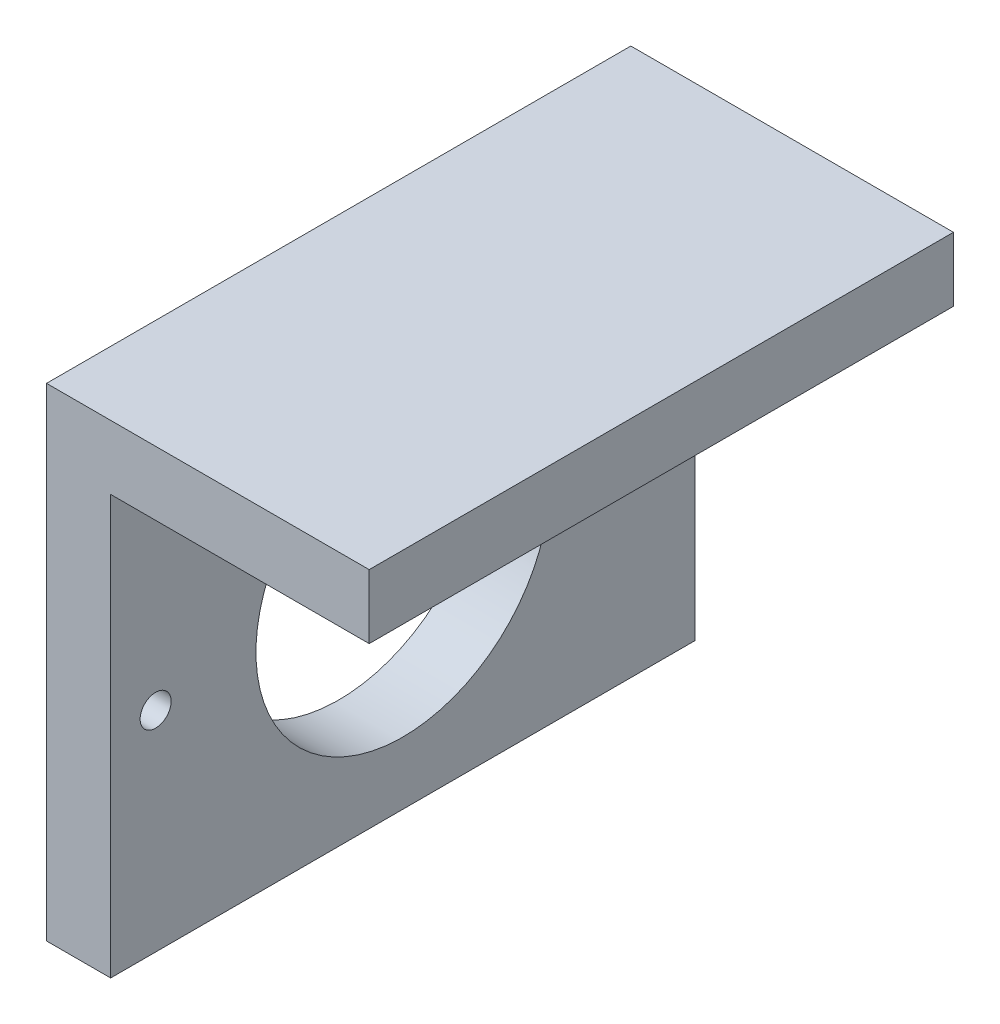
ISO-10303-21;
HEADER;
FILE_DESCRIPTION(('STEP AP214'),'2;1');
FILE_NAME('part.step','',(''),(''),'','','');
FILE_SCHEMA(('AUTOMOTIVE_DESIGN { 1 0 10303 214 1 1 1 1 }'));
ENDSEC;
DATA;
#1=APPLICATION_CONTEXT('core data for automotive mechanical design processes');
#2=APPLICATION_PROTOCOL_DEFINITION('international standard','automotive_design',2000,#1);
#3=PRODUCT_CONTEXT('',#1,'mechanical');
#4=PRODUCT('Part','Part','',(#3));
#5=PRODUCT_RELATED_PRODUCT_CATEGORY('part','',(#4));
#6=PRODUCT_DEFINITION_FORMATION('','',#4);
#7=PRODUCT_DEFINITION_CONTEXT('part definition',#1,'design');
#8=PRODUCT_DEFINITION('design','',#6,#7);
#9=PRODUCT_DEFINITION_SHAPE('','',#8);
#10=(LENGTH_UNIT() NAMED_UNIT(*) SI_UNIT(.MILLI.,.METRE.));
#11=(NAMED_UNIT(*) PLANE_ANGLE_UNIT() SI_UNIT($,.RADIAN.));
#12=(NAMED_UNIT(*) SI_UNIT($,.STERADIAN.) SOLID_ANGLE_UNIT());
#13=UNCERTAINTY_MEASURE_WITH_UNIT(LENGTH_MEASURE(1.E-05),#10,'distance_accuracy_value','');
#14=(GEOMETRIC_REPRESENTATION_CONTEXT(3) GLOBAL_UNCERTAINTY_ASSIGNED_CONTEXT((#13)) GLOBAL_UNIT_ASSIGNED_CONTEXT((#10,
#11,#12)) REPRESENTATION_CONTEXT('',''));
#15=CARTESIAN_POINT('',(0.,0.,0.));
#16=DIRECTION('',(0.,0.,1.));
#17=DIRECTION('',(1.,0.,0.));
#18=AXIS2_PLACEMENT_3D('',#15,#16,#17);
#19=CARTESIAN_POINT('',(6.2,0.,0.));
#20=DIRECTION('',(0.,1.,0.));
#21=DIRECTION('',(0.,0.,1.));
#22=AXIS2_PLACEMENT_3D('',#19,#20,#21);
#23=PLANE('',#22);
#24=DIRECTION('',(0.,0.,-1.));
#25=VECTOR('',#24,1.);
#26=CARTESIAN_POINT('',(0.,0.,0.));
#27=LINE('',#26,#25);
#28=CARTESIAN_POINT('',(0.,0.,0.));
#29=VERTEX_POINT('',#28);
#30=CARTESIAN_POINT('',(0.,0.,-56.5));
#31=VERTEX_POINT('',#30);
#32=EDGE_CURVE('E85',#29,#31,#27,.T.);
#33=ORIENTED_EDGE('',*,*,#32,.T.);
#34=DIRECTION('',(-1.,0.,0.));
#35=VECTOR('',#34,1.);
#36=CARTESIAN_POINT('',(6.2,0.,-56.5));
#37=LINE('',#36,#35);
#38=CARTESIAN_POINT('',(6.2,0.,-56.5));
#39=VERTEX_POINT('',#38);
#40=EDGE_CURVE('E11',#39,#31,#37,.T.);
#41=ORIENTED_EDGE('',*,*,#40,.F.);
#42=DIRECTION('',(0.,0.,-1.));
#43=VECTOR('',#42,1.);
#44=CARTESIAN_POINT('',(6.2,0.,0.));
#45=LINE('',#44,#43);
#46=CARTESIAN_POINT('',(6.2,0.,0.));
#47=VERTEX_POINT('',#46);
#48=EDGE_CURVE('E87',#47,#39,#45,.T.);
#49=ORIENTED_EDGE('',*,*,#48,.F.);
#50=DIRECTION('',(-1.,0.,0.));
#51=VECTOR('',#50,1.);
#52=CARTESIAN_POINT('',(6.2,0.,0.));
#53=LINE('',#52,#51);
#54=EDGE_CURVE('E65',#47,#29,#53,.T.);
#55=ORIENTED_EDGE('',*,*,#54,.T.);
#56=EDGE_LOOP('',(#33,#41,#49,#55));
#57=FACE_BOUND('',#56,.T.);
#58=ADVANCED_FACE('F41',(#57),#23,.F.);
#59=CARTESIAN_POINT('',(6.2,0.,-56.5));
#60=DIRECTION('',(0.,0.,1.));
#61=DIRECTION('',(1.,0.,0.));
#62=AXIS2_PLACEMENT_3D('',#59,#60,#61);
#63=PLANE('',#62);
#64=DIRECTION('',(0.,1.,0.));
#65=VECTOR('',#64,1.);
#66=CARTESIAN_POINT('',(0.,0.,-56.5));
#67=LINE('',#66,#65);
#68=CARTESIAN_POINT('',(0.,46.7,-56.5));
#69=VERTEX_POINT('',#68);
#70=EDGE_CURVE('E98',#31,#69,#67,.T.);
#71=ORIENTED_EDGE('',*,*,#70,.T.);
#72=DIRECTION('',(-1.,0.,0.));
#73=VECTOR('',#72,1.);
#74=CARTESIAN_POINT('',(6.2,46.7,-56.5));
#75=LINE('',#74,#73);
#76=CARTESIAN_POINT('',(31.2,46.7,-56.5));
#77=VERTEX_POINT('',#76);
#78=EDGE_CURVE('E50',#77,#69,#75,.T.);
#79=ORIENTED_EDGE('',*,*,#78,.F.);
#80=DIRECTION('',(0.,1.,0.));
#81=VECTOR('',#80,1.);
#82=CARTESIAN_POINT('',(31.2,46.7,-56.5));
#83=LINE('',#82,#81);
#84=CARTESIAN_POINT('',(31.2,40.5,-56.5));
#85=VERTEX_POINT('',#84);
#86=EDGE_CURVE('E171',#85,#77,#83,.T.);
#87=ORIENTED_EDGE('',*,*,#86,.F.);
#88=DIRECTION('',(-1.,0.,0.));
#89=VECTOR('',#88,1.);
#90=CARTESIAN_POINT('',(31.2,40.5,-56.5));
#91=LINE('',#90,#89);
#92=CARTESIAN_POINT('',(6.2,40.5,-56.5));
#93=VERTEX_POINT('',#92);
#94=EDGE_CURVE('E162',#85,#93,#91,.T.);
#95=ORIENTED_EDGE('',*,*,#94,.T.);
#96=DIRECTION('',(0.,1.,0.));
#97=VECTOR('',#96,1.);
#98=CARTESIAN_POINT('',(6.2,0.,-56.5));
#99=LINE('',#98,#97);
#100=EDGE_CURVE('E147',#39,#93,#99,.T.);
#101=ORIENTED_EDGE('',*,*,#100,.F.);
#102=ORIENTED_EDGE('',*,*,#40,.T.);
#103=EDGE_LOOP('',(#71,#79,#87,#95,#101,#102));
#104=FACE_BOUND('',#103,.T.);
#105=ADVANCED_FACE('F130',(#104),#63,.F.);
#106=CARTESIAN_POINT('',(6.2,46.7,0.));
#107=DIRECTION('',(0.,1.,0.));
#108=DIRECTION('',(0.,0.,1.));
#109=AXIS2_PLACEMENT_3D('',#106,#107,#108);
#110=PLANE('',#109);
#111=DIRECTION('',(0.,0.,-1.));
#112=VECTOR('',#111,1.);
#113=CARTESIAN_POINT('',(0.,46.7,0.));
#114=LINE('',#113,#112);
#115=CARTESIAN_POINT('',(0.,46.7,0.));
#116=VERTEX_POINT('',#115);
#117=EDGE_CURVE('E108',#116,#69,#114,.T.);
#118=ORIENTED_EDGE('',*,*,#117,.F.);
#119=DIRECTION('',(-1.,0.,0.));
#120=VECTOR('',#119,1.);
#121=CARTESIAN_POINT('',(6.2,46.7,0.));
#122=LINE('',#121,#120);
#123=CARTESIAN_POINT('',(31.2,46.7,0.));
#124=VERTEX_POINT('',#123);
#125=EDGE_CURVE('E89',#124,#116,#122,.T.);
#126=ORIENTED_EDGE('',*,*,#125,.F.);
#127=DIRECTION('',(0.,0.,1.));
#128=VECTOR('',#127,1.);
#129=CARTESIAN_POINT('',(31.2,46.7,0.));
#130=LINE('',#129,#128);
#131=EDGE_CURVE('E126',#77,#124,#130,.T.);
#132=ORIENTED_EDGE('',*,*,#131,.F.);
#133=ORIENTED_EDGE('',*,*,#78,.T.);
#134=EDGE_LOOP('',(#118,#126,#132,#133));
#135=FACE_BOUND('',#134,.T.);
#136=ADVANCED_FACE('F123',(#135),#110,.T.);
#137=CARTESIAN_POINT('',(6.2,20.25,-28.25));
#138=DIRECTION('',(-1.,0.,0.));
#139=DIRECTION('',(0.,0.,1.));
#140=AXIS2_PLACEMENT_3D('',#137,#138,#139);
#141=CYLINDRICAL_SURFACE('',#140,14.2);
#142=CARTESIAN_POINT('',(6.2,20.25,-28.25));
#143=DIRECTION('',(1.,0.,0.));
#144=DIRECTION('',(0.,0.,-1.));
#145=AXIS2_PLACEMENT_3D('',#142,#143,#144);
#146=CIRCLE('',#145,14.2);
#147=CARTESIAN_POINT('',(6.2,20.25,-42.45));
#148=VERTEX_POINT('',#147);
#149=EDGE_CURVE('E152',#148,#148,#146,.T.);
#150=ORIENTED_EDGE('',*,*,#149,.T.);
#151=EDGE_LOOP('',(#150));
#152=FACE_BOUND('',#151,.T.);
#153=CARTESIAN_POINT('',(0.,20.25,-28.25));
#154=DIRECTION('',(1.,0.,0.));
#155=DIRECTION('',(0.,0.,-1.));
#156=AXIS2_PLACEMENT_3D('',#153,#154,#155);
#157=CIRCLE('',#156,14.2);
#158=CARTESIAN_POINT('',(0.,20.25,-42.45));
#159=VERTEX_POINT('',#158);
#160=EDGE_CURVE('E100',#159,#159,#157,.T.);
#161=ORIENTED_EDGE('',*,*,#160,.F.);
#162=EDGE_LOOP('',(#161));
#163=FACE_BOUND('',#162,.T.);
#164=ADVANCED_FACE('F204',(#152,#163),#141,.F.);
#165=CARTESIAN_POINT('',(6.2,20.25,-4.35000000000005));
#166=DIRECTION('',(-1.,0.,0.));
#167=DIRECTION('',(0.,0.,1.));
#168=AXIS2_PLACEMENT_3D('',#165,#166,#167);
#169=CYLINDRICAL_SURFACE('',#168,1.5);
#170=CARTESIAN_POINT('',(6.2,20.25,-4.35000000000005));
#171=DIRECTION('',(1.,0.,0.));
#172=DIRECTION('',(0.,0.,-1.));
#173=AXIS2_PLACEMENT_3D('',#170,#171,#172);
#174=CIRCLE('',#173,1.5);
#175=CARTESIAN_POINT('',(6.2,20.25,-5.85000000000005));
#176=VERTEX_POINT('',#175);
#177=EDGE_CURVE('E113',#176,#176,#174,.T.);
#178=ORIENTED_EDGE('',*,*,#177,.T.);
#179=EDGE_LOOP('',(#178));
#180=FACE_BOUND('',#179,.T.);
#181=CARTESIAN_POINT('',(0.,20.25,-4.35000000000005));
#182=DIRECTION('',(1.,0.,0.));
#183=DIRECTION('',(0.,0.,-1.));
#184=AXIS2_PLACEMENT_3D('',#181,#182,#183);
#185=CIRCLE('',#184,1.5);
#186=CARTESIAN_POINT('',(0.,20.25,-5.85000000000005));
#187=VERTEX_POINT('',#186);
#188=EDGE_CURVE('E136',#187,#187,#185,.T.);
#189=ORIENTED_EDGE('',*,*,#188,.F.);
#190=EDGE_LOOP('',(#189));
#191=FACE_BOUND('',#190,.T.);
#192=ADVANCED_FACE('F207',(#180,#191),#169,.F.);
#193=CARTESIAN_POINT('',(6.2,20.25,-52.1500000000001));
#194=DIRECTION('',(-1.,0.,0.));
#195=DIRECTION('',(0.,0.,1.));
#196=AXIS2_PLACEMENT_3D('',#193,#194,#195);
#197=CYLINDRICAL_SURFACE('',#196,1.5);
#198=CARTESIAN_POINT('',(6.2,20.25,-52.1500000000001));
#199=DIRECTION('',(1.,0.,0.));
#200=DIRECTION('',(0.,0.,-1.));
#201=AXIS2_PLACEMENT_3D('',#198,#199,#200);
#202=CIRCLE('',#201,1.5);
#203=CARTESIAN_POINT('',(6.2,20.25,-53.6500000000001));
#204=VERTEX_POINT('',#203);
#205=EDGE_CURVE('E107',#204,#204,#202,.T.);
#206=ORIENTED_EDGE('',*,*,#205,.T.);
#207=EDGE_LOOP('',(#206));
#208=FACE_BOUND('',#207,.T.);
#209=CARTESIAN_POINT('',(0.,20.25,-52.1500000000001));
#210=DIRECTION('',(1.,0.,0.));
#211=DIRECTION('',(0.,0.,-1.));
#212=AXIS2_PLACEMENT_3D('',#209,#210,#211);
#213=CIRCLE('',#212,1.5);
#214=CARTESIAN_POINT('',(0.,20.25,-53.6500000000001));
#215=VERTEX_POINT('',#214);
#216=EDGE_CURVE('E140',#215,#215,#213,.T.);
#217=ORIENTED_EDGE('',*,*,#216,.F.);
#218=EDGE_LOOP('',(#217));
#219=FACE_BOUND('',#218,.T.);
#220=ADVANCED_FACE('F43',(#208,#219),#197,.F.);
#221=CARTESIAN_POINT('',(6.2,0.,0.));
#222=DIRECTION('',(0.,0.,1.));
#223=DIRECTION('',(0.,-1.,0.));
#224=AXIS2_PLACEMENT_3D('',#221,#222,#223);
#225=PLANE('',#224);
#226=DIRECTION('',(0.,1.,0.));
#227=VECTOR('',#226,1.);
#228=CARTESIAN_POINT('',(0.,0.,0.));
#229=LINE('',#228,#227);
#230=EDGE_CURVE('E96',#29,#116,#229,.T.);
#231=ORIENTED_EDGE('',*,*,#230,.F.);
#232=ORIENTED_EDGE('',*,*,#54,.F.);
#233=DIRECTION('',(0.,1.,0.));
#234=VECTOR('',#233,1.);
#235=CARTESIAN_POINT('',(6.2,0.,0.));
#236=LINE('',#235,#234);
#237=CARTESIAN_POINT('',(6.2,40.5,0.));
#238=VERTEX_POINT('',#237);
#239=EDGE_CURVE('E90',#47,#238,#236,.T.);
#240=ORIENTED_EDGE('',*,*,#239,.T.);
#241=DIRECTION('',(-1.,0.,0.));
#242=VECTOR('',#241,1.);
#243=CARTESIAN_POINT('',(31.2,40.5,0.));
#244=LINE('',#243,#242);
#245=CARTESIAN_POINT('',(31.2,40.5,0.));
#246=VERTEX_POINT('',#245);
#247=EDGE_CURVE('E144',#246,#238,#244,.T.);
#248=ORIENTED_EDGE('',*,*,#247,.F.);
#249=DIRECTION('',(0.,-1.,0.));
#250=VECTOR('',#249,1.);
#251=CARTESIAN_POINT('',(31.2,46.7,0.));
#252=LINE('',#251,#250);
#253=EDGE_CURVE('E168',#124,#246,#252,.T.);
#254=ORIENTED_EDGE('',*,*,#253,.F.);
#255=ORIENTED_EDGE('',*,*,#125,.T.);
#256=EDGE_LOOP('',(#231,#232,#240,#248,#254,#255));
#257=FACE_BOUND('',#256,.T.);
#258=ADVANCED_FACE('F102',(#257),#225,.T.);
#259=CARTESIAN_POINT('',(6.2,0.,0.));
#260=DIRECTION('',(1.,0.,0.));
#261=DIRECTION('',(0.,0.,-1.));
#262=AXIS2_PLACEMENT_3D('',#259,#260,#261);
#263=PLANE('',#262);
#264=DIRECTION('',(0.,0.,-1.));
#265=VECTOR('',#264,1.);
#266=CARTESIAN_POINT('',(6.2,40.5,0.));
#267=LINE('',#266,#265);
#268=EDGE_CURVE('E57',#238,#93,#267,.T.);
#269=ORIENTED_EDGE('',*,*,#268,.F.);
#270=ORIENTED_EDGE('',*,*,#239,.F.);
#271=ORIENTED_EDGE('',*,*,#48,.T.);
#272=ORIENTED_EDGE('',*,*,#100,.T.);
#273=EDGE_LOOP('',(#269,#270,#271,#272));
#274=FACE_BOUND('',#273,.T.);
#275=ORIENTED_EDGE('',*,*,#205,.F.);
#276=EDGE_LOOP('',(#275));
#277=FACE_BOUND('',#276,.T.);
#278=ORIENTED_EDGE('',*,*,#177,.F.);
#279=EDGE_LOOP('',(#278));
#280=FACE_BOUND('',#279,.T.);
#281=ORIENTED_EDGE('',*,*,#149,.F.);
#282=EDGE_LOOP('',(#281));
#283=FACE_BOUND('',#282,.T.);
#284=ADVANCED_FACE('F194',(#274,#277,#280,#283),#263,.T.);
#285=CARTESIAN_POINT('',(0.,0.,0.));
#286=DIRECTION('',(1.,0.,0.));
#287=DIRECTION('',(0.,0.,-1.));
#288=AXIS2_PLACEMENT_3D('',#285,#286,#287);
#289=PLANE('',#288);
#290=ORIENTED_EDGE('',*,*,#216,.T.);
#291=EDGE_LOOP('',(#290));
#292=FACE_BOUND('',#291,.T.);
#293=ORIENTED_EDGE('',*,*,#188,.T.);
#294=EDGE_LOOP('',(#293));
#295=FACE_BOUND('',#294,.T.);
#296=ORIENTED_EDGE('',*,*,#160,.T.);
#297=EDGE_LOOP('',(#296));
#298=FACE_BOUND('',#297,.T.);
#299=ORIENTED_EDGE('',*,*,#32,.F.);
#300=ORIENTED_EDGE('',*,*,#230,.T.);
#301=ORIENTED_EDGE('',*,*,#117,.T.);
#302=ORIENTED_EDGE('',*,*,#70,.F.);
#303=EDGE_LOOP('',(#299,#300,#301,#302));
#304=FACE_BOUND('',#303,.T.);
#305=ADVANCED_FACE('F94',(#292,#295,#298,#304),#289,.F.);
#306=CARTESIAN_POINT('',(31.2,40.5,0.));
#307=DIRECTION('',(0.,1.,0.));
#308=DIRECTION('',(0.,0.,1.));
#309=AXIS2_PLACEMENT_3D('',#306,#307,#308);
#310=PLANE('',#309);
#311=ORIENTED_EDGE('',*,*,#268,.T.);
#312=ORIENTED_EDGE('',*,*,#94,.F.);
#313=DIRECTION('',(0.,0.,-1.));
#314=VECTOR('',#313,1.);
#315=CARTESIAN_POINT('',(31.2,40.5,0.));
#316=LINE('',#315,#314);
#317=EDGE_CURVE('E174',#246,#85,#316,.T.);
#318=ORIENTED_EDGE('',*,*,#317,.F.);
#319=ORIENTED_EDGE('',*,*,#247,.T.);
#320=EDGE_LOOP('',(#311,#312,#318,#319));
#321=FACE_BOUND('',#320,.T.);
#322=ADVANCED_FACE('F190',(#321),#310,.F.);
#323=CARTESIAN_POINT('',(31.2,0.,0.));
#324=DIRECTION('',(1.,0.,0.));
#325=DIRECTION('',(0.,0.,-1.));
#326=AXIS2_PLACEMENT_3D('',#323,#324,#325);
#327=PLANE('',#326);
#328=ORIENTED_EDGE('',*,*,#253,.T.);
#329=ORIENTED_EDGE('',*,*,#317,.T.);
#330=ORIENTED_EDGE('',*,*,#86,.T.);
#331=ORIENTED_EDGE('',*,*,#131,.T.);
#332=EDGE_LOOP('',(#328,#329,#330,#331));
#333=FACE_BOUND('',#332,.T.);
#334=ADVANCED_FACE('F183',(#333),#327,.T.);
#335=CLOSED_SHELL('',(#58,#105,#136,#164,#192,#220,#258,#284,#305,#322,#334));
#336=MANIFOLD_SOLID_BREP('B2',#335);
#337=ADVANCED_BREP_SHAPE_REPRESENTATION('',(#18,#336),#14);
#338=SHAPE_DEFINITION_REPRESENTATION(#9,#337);
ENDSEC;
END-ISO-10303-21;
